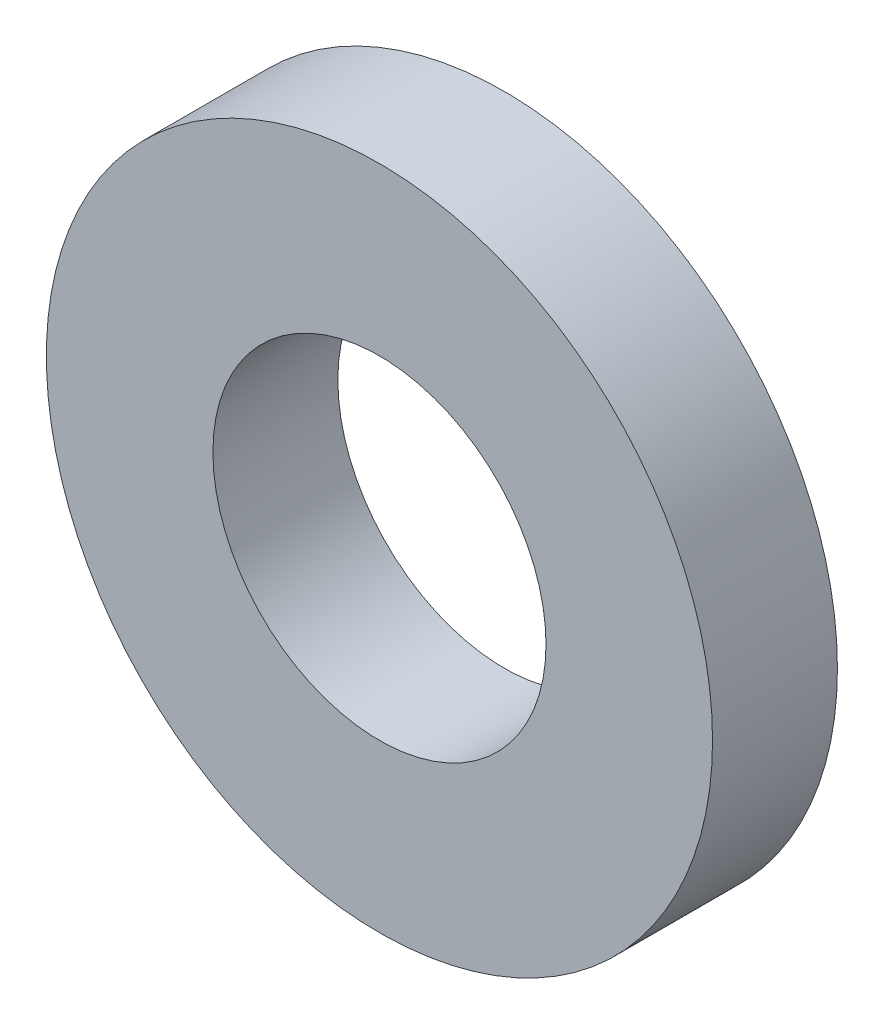
ISO-10303-21;
HEADER;
FILE_DESCRIPTION(('STEP AP214'),'2;1');
FILE_NAME('part.step','',(''),(''),'','','');
FILE_SCHEMA(('AUTOMOTIVE_DESIGN { 1 0 10303 214 1 1 1 1 }'));
ENDSEC;
DATA;
#1=APPLICATION_CONTEXT('core data for automotive mechanical design processes');
#2=APPLICATION_PROTOCOL_DEFINITION('international standard','automotive_design',2000,#1);
#3=PRODUCT_CONTEXT('',#1,'mechanical');
#4=PRODUCT('Part','Part','',(#3));
#5=PRODUCT_RELATED_PRODUCT_CATEGORY('part','',(#4));
#6=PRODUCT_DEFINITION_FORMATION('','',#4);
#7=PRODUCT_DEFINITION_CONTEXT('part definition',#1,'design');
#8=PRODUCT_DEFINITION('design','',#6,#7);
#9=PRODUCT_DEFINITION_SHAPE('','',#8);
#10=(LENGTH_UNIT() NAMED_UNIT(*) SI_UNIT(.MILLI.,.METRE.));
#11=(NAMED_UNIT(*) PLANE_ANGLE_UNIT() SI_UNIT($,.RADIAN.));
#12=(NAMED_UNIT(*) SI_UNIT($,.STERADIAN.) SOLID_ANGLE_UNIT());
#13=UNCERTAINTY_MEASURE_WITH_UNIT(LENGTH_MEASURE(1.E-05),#10,'distance_accuracy_value','');
#14=(GEOMETRIC_REPRESENTATION_CONTEXT(3) GLOBAL_UNCERTAINTY_ASSIGNED_CONTEXT((#13)) GLOBAL_UNIT_ASSIGNED_CONTEXT((#10,
#11,#12)) REPRESENTATION_CONTEXT('',''));
#15=CARTESIAN_POINT('',(0.,0.,0.));
#16=DIRECTION('',(0.,0.,1.));
#17=DIRECTION('',(1.,0.,0.));
#18=AXIS2_PLACEMENT_3D('',#15,#16,#17);
#19=CARTESIAN_POINT('',(0.,0.,3.));
#20=DIRECTION('',(0.,0.,1.));
#21=DIRECTION('',(1.,0.,0.));
#22=AXIS2_PLACEMENT_3D('',#19,#20,#21);
#23=PLANE('',#22);
#24=CARTESIAN_POINT('',(0.,0.,3.));
#25=DIRECTION('',(0.,0.,1.));
#26=DIRECTION('',(1.,0.,0.));
#27=AXIS2_PLACEMENT_3D('',#24,#25,#26);
#28=CIRCLE('',#27,8.);
#29=CARTESIAN_POINT('',(8.,0.,3.));
#30=VERTEX_POINT('',#29);
#31=EDGE_CURVE('E10',#30,#30,#28,.T.);
#32=ORIENTED_EDGE('',*,*,#31,.T.);
#33=EDGE_LOOP('',(#32));
#34=FACE_BOUND('',#33,.T.);
#35=CARTESIAN_POINT('',(0.,0.,3.));
#36=DIRECTION('',(0.,0.,1.));
#37=DIRECTION('',(1.,0.,0.));
#38=AXIS2_PLACEMENT_3D('',#35,#36,#37);
#39=CIRCLE('',#38,4.);
#40=CARTESIAN_POINT('',(4.,0.,3.));
#41=VERTEX_POINT('',#40);
#42=EDGE_CURVE('E44',#41,#41,#39,.T.);
#43=ORIENTED_EDGE('',*,*,#42,.F.);
#44=EDGE_LOOP('',(#43));
#45=FACE_BOUND('',#44,.T.);
#46=ADVANCED_FACE('F33',(#34,#45),#23,.T.);
#47=CARTESIAN_POINT('',(0.,0.,0.));
#48=DIRECTION('',(0.,0.,1.));
#49=DIRECTION('',(1.,0.,0.));
#50=AXIS2_PLACEMENT_3D('',#47,#48,#49);
#51=PLANE('',#50);
#52=CARTESIAN_POINT('',(0.,0.,0.));
#53=DIRECTION('',(0.,0.,1.));
#54=DIRECTION('',(1.,0.,0.));
#55=AXIS2_PLACEMENT_3D('',#52,#53,#54);
#56=CIRCLE('',#55,8.);
#57=CARTESIAN_POINT('',(8.,0.,0.));
#58=VERTEX_POINT('',#57);
#59=EDGE_CURVE('E37',#58,#58,#56,.T.);
#60=ORIENTED_EDGE('',*,*,#59,.F.);
#61=EDGE_LOOP('',(#60));
#62=FACE_BOUND('',#61,.T.);
#63=CARTESIAN_POINT('',(0.,0.,0.));
#64=DIRECTION('',(0.,0.,1.));
#65=DIRECTION('',(1.,0.,0.));
#66=AXIS2_PLACEMENT_3D('',#63,#64,#65);
#67=CIRCLE('',#66,4.);
#68=CARTESIAN_POINT('',(4.,0.,0.));
#69=VERTEX_POINT('',#68);
#70=EDGE_CURVE('E46',#69,#69,#67,.T.);
#71=ORIENTED_EDGE('',*,*,#70,.T.);
#72=EDGE_LOOP('',(#71));
#73=FACE_BOUND('',#72,.T.);
#74=ADVANCED_FACE('F56',(#62,#73),#51,.F.);
#75=CARTESIAN_POINT('',(0.,0.,3.));
#76=DIRECTION('',(0.,0.,-1.));
#77=DIRECTION('',(-1.,0.,0.));
#78=AXIS2_PLACEMENT_3D('',#75,#76,#77);
#79=CYLINDRICAL_SURFACE('',#78,8.);
#80=ORIENTED_EDGE('',*,*,#31,.F.);
#81=EDGE_LOOP('',(#80));
#82=FACE_BOUND('',#81,.T.);
#83=ORIENTED_EDGE('',*,*,#59,.T.);
#84=EDGE_LOOP('',(#83));
#85=FACE_BOUND('',#84,.T.);
#86=ADVANCED_FACE('F35',(#82,#85),#79,.T.);
#87=CARTESIAN_POINT('',(0.,0.,3.));
#88=DIRECTION('',(0.,0.,-1.));
#89=DIRECTION('',(-1.,0.,0.));
#90=AXIS2_PLACEMENT_3D('',#87,#88,#89);
#91=CYLINDRICAL_SURFACE('',#90,4.);
#92=ORIENTED_EDGE('',*,*,#42,.T.);
#93=EDGE_LOOP('',(#92));
#94=FACE_BOUND('',#93,.T.);
#95=ORIENTED_EDGE('',*,*,#70,.F.);
#96=EDGE_LOOP('',(#95));
#97=FACE_BOUND('',#96,.T.);
#98=ADVANCED_FACE('F52',(#94,#97),#91,.F.);
#99=CLOSED_SHELL('',(#46,#74,#86,#98));
#100=MANIFOLD_SOLID_BREP('B2',#99);
#101=ADVANCED_BREP_SHAPE_REPRESENTATION('',(#18,#100),#14);
#102=SHAPE_DEFINITION_REPRESENTATION(#9,#101);
ENDSEC;
END-ISO-10303-21;
